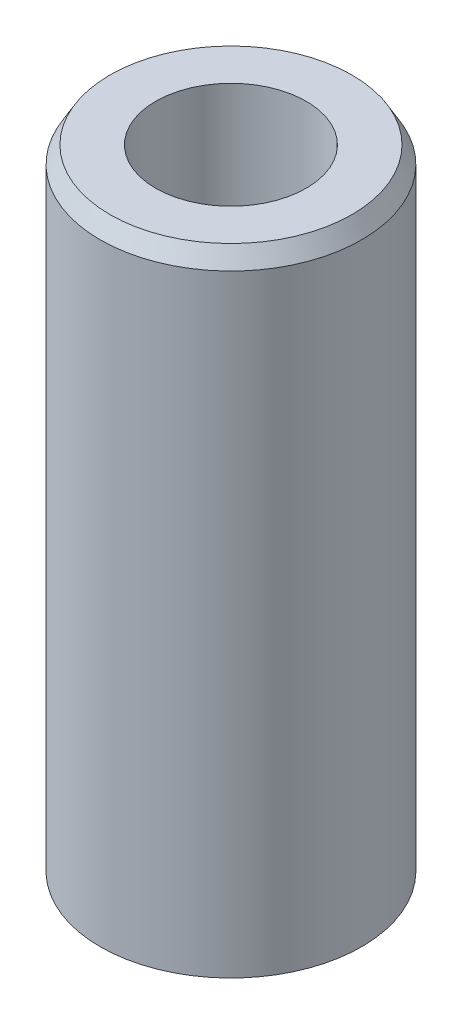
ISO-10303-21;
HEADER;
FILE_DESCRIPTION(('STEP AP214'),'2;1');
FILE_NAME('part.step','',(''),(''),'','','');
FILE_SCHEMA(('AUTOMOTIVE_DESIGN { 1 0 10303 214 1 1 1 1 }'));
ENDSEC;
DATA;
#1=APPLICATION_CONTEXT('core data for automotive mechanical design processes');
#2=APPLICATION_PROTOCOL_DEFINITION('international standard','automotive_design',2000,#1);
#3=PRODUCT_CONTEXT('',#1,'mechanical');
#4=PRODUCT('Part','Part','',(#3));
#5=PRODUCT_RELATED_PRODUCT_CATEGORY('part','',(#4));
#6=PRODUCT_DEFINITION_FORMATION('','',#4);
#7=PRODUCT_DEFINITION_CONTEXT('part definition',#1,'design');
#8=PRODUCT_DEFINITION('design','',#6,#7);
#9=PRODUCT_DEFINITION_SHAPE('','',#8);
#10=(LENGTH_UNIT() NAMED_UNIT(*) SI_UNIT(.MILLI.,.METRE.));
#11=(NAMED_UNIT(*) PLANE_ANGLE_UNIT() SI_UNIT($,.RADIAN.));
#12=(NAMED_UNIT(*) SI_UNIT($,.STERADIAN.) SOLID_ANGLE_UNIT());
#13=UNCERTAINTY_MEASURE_WITH_UNIT(LENGTH_MEASURE(1.E-05),#10,'distance_accuracy_value','');
#14=(GEOMETRIC_REPRESENTATION_CONTEXT(3) GLOBAL_UNCERTAINTY_ASSIGNED_CONTEXT((#13)) GLOBAL_UNIT_ASSIGNED_CONTEXT((#10,
#11,#12)) REPRESENTATION_CONTEXT('',''));
#15=CARTESIAN_POINT('',(0.,0.,0.));
#16=DIRECTION('',(0.,0.,1.));
#17=DIRECTION('',(1.,0.,0.));
#18=AXIS2_PLACEMENT_3D('',#15,#16,#17);
#19=CARTESIAN_POINT('',(0.,195.48103093915,0.));
#20=DIRECTION('',(0.,-1.,0.));
#21=DIRECTION('',(0.,0.,-1.));
#22=AXIS2_PLACEMENT_3D('',#19,#20,#21);
#23=CYLINDRICAL_SURFACE('',#22,40.);
#24=CARTESIAN_POINT('',(0.,190.296744199562,0.));
#25=DIRECTION('',(0.,1.,0.));
#26=DIRECTION('',(0.,0.,1.));
#27=AXIS2_PLACEMENT_3D('',#24,#25,#26);
#28=CIRCLE('',#27,40.);
#29=CARTESIAN_POINT('',(0.,190.296744199562,40.));
#30=VERTEX_POINT('',#29);
#31=EDGE_CURVE('E50',#30,#30,#28,.F.);
#32=ORIENTED_EDGE('',*,*,#31,.T.);
#33=EDGE_LOOP('',(#32));
#34=FACE_BOUND('',#33,.T.);
#35=CARTESIAN_POINT('',(0.,2.99314934465694,0.));
#36=DIRECTION('',(0.,1.,0.));
#37=DIRECTION('',(0.,0.,1.));
#38=AXIS2_PLACEMENT_3D('',#35,#36,#37);
#39=CIRCLE('',#38,40.);
#40=CARTESIAN_POINT('',(0.,2.99314934465694,40.));
#41=VERTEX_POINT('',#40);
#42=EDGE_CURVE('E51',#41,#41,#39,.T.);
#43=ORIENTED_EDGE('',*,*,#42,.T.);
#44=EDGE_LOOP('',(#43));
#45=FACE_BOUND('',#44,.T.);
#46=ADVANCED_FACE('F39',(#34,#45),#23,.T.);
#47=CARTESIAN_POINT('',(0.,195.48103093915,0.));
#48=DIRECTION('',(0.,1.,0.));
#49=DIRECTION('',(0.,0.,1.));
#50=AXIS2_PLACEMENT_3D('',#47,#48,#49);
#51=PLANE('',#50);
#52=CARTESIAN_POINT('',(0.,195.48103093915,0.));
#53=DIRECTION('',(0.,1.,0.));
#54=DIRECTION('',(0.,0.,1.));
#55=AXIS2_PLACEMENT_3D('',#52,#53,#54);
#56=CIRCLE('',#55,37.0068506553431);
#57=CARTESIAN_POINT('',(0.,195.48103093915,37.0068506553431));
#58=VERTEX_POINT('',#57);
#59=EDGE_CURVE('E54',#58,#58,#56,.T.);
#60=ORIENTED_EDGE('',*,*,#59,.T.);
#61=EDGE_LOOP('',(#60));
#62=FACE_BOUND('',#61,.T.);
#63=CARTESIAN_POINT('',(0.,195.48103093915,0.));
#64=DIRECTION('',(0.,1.,0.));
#65=DIRECTION('',(0.,0.,1.));
#66=AXIS2_PLACEMENT_3D('',#63,#64,#65);
#67=CIRCLE('',#66,23.0458268509122);
#68=CARTESIAN_POINT('',(0.,195.48103093915,23.0458268509122));
#69=VERTEX_POINT('',#68);
#70=EDGE_CURVE('E58',#69,#69,#67,.T.);
#71=ORIENTED_EDGE('',*,*,#70,.F.);
#72=EDGE_LOOP('',(#71));
#73=FACE_BOUND('',#72,.T.);
#74=ADVANCED_FACE('F69',(#62,#73),#51,.T.);
#75=CARTESIAN_POINT('',(0.,0.,0.));
#76=DIRECTION('',(0.,1.,0.));
#77=DIRECTION('',(0.,0.,1.));
#78=AXIS2_PLACEMENT_3D('',#75,#76,#77);
#79=PLANE('',#78);
#80=CARTESIAN_POINT('',(0.,0.,0.));
#81=DIRECTION('',(0.,1.,0.));
#82=DIRECTION('',(0.,0.,1.));
#83=AXIS2_PLACEMENT_3D('',#80,#81,#82);
#84=CIRCLE('',#83,34.8157132604126);
#85=CARTESIAN_POINT('',(0.,0.,34.8157132604126));
#86=VERTEX_POINT('',#85);
#87=EDGE_CURVE('E10',#86,#86,#84,.F.);
#88=ORIENTED_EDGE('',*,*,#87,.T.);
#89=EDGE_LOOP('',(#88));
#90=FACE_BOUND('',#89,.T.);
#91=CARTESIAN_POINT('',(0.,0.,0.));
#92=DIRECTION('',(0.,1.,0.));
#93=DIRECTION('',(0.,0.,1.));
#94=AXIS2_PLACEMENT_3D('',#91,#92,#93);
#95=CIRCLE('',#94,23.0458268509122);
#96=CARTESIAN_POINT('',(0.,0.,23.0458268509122));
#97=VERTEX_POINT('',#96);
#98=EDGE_CURVE('E63',#97,#97,#95,.T.);
#99=ORIENTED_EDGE('',*,*,#98,.T.);
#100=EDGE_LOOP('',(#99));
#101=FACE_BOUND('',#100,.T.);
#102=ADVANCED_FACE('F75',(#90,#101),#79,.F.);
#103=CARTESIAN_POINT('',(0.,195.48103093915,0.));
#104=DIRECTION('',(0.,-1.,0.));
#105=DIRECTION('',(0.,0.,-1.));
#106=AXIS2_PLACEMENT_3D('',#103,#104,#105);
#107=CYLINDRICAL_SURFACE('',#106,23.0458268509122);
#108=ORIENTED_EDGE('',*,*,#70,.T.);
#109=EDGE_LOOP('',(#108));
#110=FACE_BOUND('',#109,.T.);
#111=ORIENTED_EDGE('',*,*,#98,.F.);
#112=EDGE_LOOP('',(#111));
#113=FACE_BOUND('',#112,.T.);
#114=ADVANCED_FACE('F70',(#110,#113),#107,.F.);
#115=CARTESIAN_POINT('',(0.,195.48103093915,0.));
#116=DIRECTION('',(0.,-1.,0.));
#117=DIRECTION('',(0.,0.,-1.));
#118=AXIS2_PLACEMENT_3D('',#115,#116,#117);
#119=CONICAL_SURFACE('',#118,37.0068506553431,0.523598775598293);
#120=ORIENTED_EDGE('',*,*,#31,.F.);
#121=EDGE_LOOP('',(#120));
#122=FACE_BOUND('',#121,.T.);
#123=ORIENTED_EDGE('',*,*,#59,.F.);
#124=EDGE_LOOP('',(#123));
#125=FACE_BOUND('',#124,.T.);
#126=ADVANCED_FACE('F81',(#122,#125),#119,.T.);
#127=CARTESIAN_POINT('',(0.,2.99314934465694,0.));
#128=DIRECTION('',(0.,1.,0.));
#129=DIRECTION('',(0.,0.,1.));
#130=AXIS2_PLACEMENT_3D('',#127,#128,#129);
#131=CONICAL_SURFACE('',#130,40.,1.0471975511966);
#132=ORIENTED_EDGE('',*,*,#87,.F.);
#133=EDGE_LOOP('',(#132));
#134=FACE_BOUND('',#133,.T.);
#135=ORIENTED_EDGE('',*,*,#42,.F.);
#136=EDGE_LOOP('',(#135));
#137=FACE_BOUND('',#136,.T.);
#138=ADVANCED_FACE('F45',(#134,#137),#131,.T.);
#139=CLOSED_SHELL('',(#46,#74,#102,#114,#126,#138));
#140=MANIFOLD_SOLID_BREP('B2',#139);
#141=ADVANCED_BREP_SHAPE_REPRESENTATION('',(#18,#140),#14);
#142=SHAPE_DEFINITION_REPRESENTATION(#9,#141);
ENDSEC;
END-ISO-10303-21;
